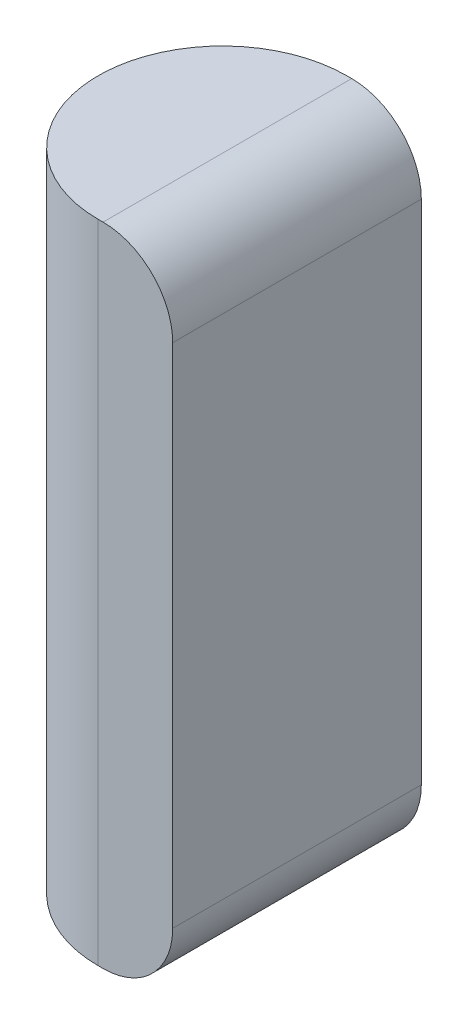
ISO-10303-21;
HEADER;
FILE_DESCRIPTION(('STEP AP214'),'2;1');
FILE_NAME('part.step','',(''),(''),'','','');
FILE_SCHEMA(('AUTOMOTIVE_DESIGN { 1 0 10303 214 1 1 1 1 }'));
ENDSEC;
DATA;
#1=APPLICATION_CONTEXT('core data for automotive mechanical design processes');
#2=APPLICATION_PROTOCOL_DEFINITION('international standard','automotive_design',2000,#1);
#3=PRODUCT_CONTEXT('',#1,'mechanical');
#4=PRODUCT('Part','Part','',(#3));
#5=PRODUCT_RELATED_PRODUCT_CATEGORY('part','',(#4));
#6=PRODUCT_DEFINITION_FORMATION('','',#4);
#7=PRODUCT_DEFINITION_CONTEXT('part definition',#1,'design');
#8=PRODUCT_DEFINITION('design','',#6,#7);
#9=PRODUCT_DEFINITION_SHAPE('','',#8);
#10=(LENGTH_UNIT() NAMED_UNIT(*) SI_UNIT(.MILLI.,.METRE.));
#11=(NAMED_UNIT(*) PLANE_ANGLE_UNIT() SI_UNIT($,.RADIAN.));
#12=(NAMED_UNIT(*) SI_UNIT($,.STERADIAN.) SOLID_ANGLE_UNIT());
#13=UNCERTAINTY_MEASURE_WITH_UNIT(LENGTH_MEASURE(1.E-05),#10,'distance_accuracy_value','');
#14=(GEOMETRIC_REPRESENTATION_CONTEXT(3) GLOBAL_UNCERTAINTY_ASSIGNED_CONTEXT((#13)) GLOBAL_UNIT_ASSIGNED_CONTEXT((#10,
#11,#12)) REPRESENTATION_CONTEXT('',''));
#15=CARTESIAN_POINT('',(0.,0.,0.));
#16=DIRECTION('',(0.,0.,1.));
#17=DIRECTION('',(1.,0.,0.));
#18=AXIS2_PLACEMENT_3D('',#15,#16,#17);
#19=CARTESIAN_POINT('',(0.,0.,0.));
#20=DIRECTION('',(0.,1.,0.));
#21=DIRECTION('',(0.,0.,1.));
#22=AXIS2_PLACEMENT_3D('',#19,#20,#21);
#23=PLANE('',#22);
#24=DIRECTION('',(1.,0.,0.));
#25=VECTOR('',#24,1.);
#26=CARTESIAN_POINT('',(0.,0.,0.125));
#27=LINE('',#26,#25);
#28=CARTESIAN_POINT('',(0.725,0.,0.125));
#29=VERTEX_POINT('',#28);
#30=CARTESIAN_POINT('',(0.73,0.,0.125));
#31=VERTEX_POINT('',#30);
#32=EDGE_CURVE('E11',#29,#31,#27,.T.);
#33=ORIENTED_EDGE('',*,*,#32,.F.);
#34=CARTESIAN_POINT('',(0.725,0.,0.));
#35=DIRECTION('',(0.,1.,0.));
#36=DIRECTION('',(0.,0.,1.));
#37=AXIS2_PLACEMENT_3D('',#34,#35,#36);
#38=CIRCLE('',#37,0.125);
#39=CARTESIAN_POINT('',(0.725,0.,-0.125));
#40=VERTEX_POINT('',#39);
#41=EDGE_CURVE('E24',#40,#29,#38,.T.);
#42=ORIENTED_EDGE('',*,*,#41,.F.);
#43=DIRECTION('',(-1.,0.,0.));
#44=VECTOR('',#43,1.);
#45=CARTESIAN_POINT('',(0.,0.,-0.125));
#46=LINE('',#45,#44);
#47=CARTESIAN_POINT('',(0.73,0.,-0.125));
#48=VERTEX_POINT('',#47);
#49=EDGE_CURVE('E117',#48,#40,#46,.T.);
#50=ORIENTED_EDGE('',*,*,#49,.F.);
#51=DIRECTION('',(0.,0.,1.));
#52=VECTOR('',#51,1.);
#53=CARTESIAN_POINT('',(0.73,0.,0.));
#54=LINE('',#53,#52);
#55=EDGE_CURVE('E115',#48,#31,#54,.T.);
#56=ORIENTED_EDGE('',*,*,#55,.T.);
#57=EDGE_LOOP('',(#33,#42,#50,#56));
#58=FACE_BOUND('',#57,.T.);
#59=ADVANCED_FACE('F17',(#58),#23,.F.);
#60=CARTESIAN_POINT('',(0.73,0.07,0.4));
#61=DIRECTION('',(0.,0.,-1.));
#62=DIRECTION('',(-1.,0.,0.));
#63=AXIS2_PLACEMENT_3D('',#60,#61,#62);
#64=CYLINDRICAL_SURFACE('',#63,0.07);
#65=DIRECTION('',(0.,0.,-1.));
#66=VECTOR('',#65,1.);
#67=CARTESIAN_POINT('',(0.8,0.07,0.4));
#68=LINE('',#67,#66);
#69=CARTESIAN_POINT('',(0.8,0.07,0.125));
#70=VERTEX_POINT('',#69);
#71=CARTESIAN_POINT('',(0.8,0.07,-0.125));
#72=VERTEX_POINT('',#71);
#73=EDGE_CURVE('E113',#70,#72,#68,.T.);
#74=ORIENTED_EDGE('',*,*,#73,.F.);
#75=CARTESIAN_POINT('',(0.73,0.07,0.125));
#76=DIRECTION('',(0.,0.,-1.));
#77=DIRECTION('',(1.,0.,0.));
#78=AXIS2_PLACEMENT_3D('',#75,#76,#77);
#79=CIRCLE('',#78,0.07);
#80=EDGE_CURVE('E110',#70,#31,#79,.T.);
#81=ORIENTED_EDGE('',*,*,#80,.T.);
#82=ORIENTED_EDGE('',*,*,#55,.F.);
#83=CARTESIAN_POINT('',(0.73,0.07,-0.125));
#84=DIRECTION('',(0.,0.,1.));
#85=DIRECTION('',(-1.,0.,0.));
#86=AXIS2_PLACEMENT_3D('',#83,#84,#85);
#87=CIRCLE('',#86,0.07);
#88=EDGE_CURVE('E107',#48,#72,#87,.T.);
#89=ORIENTED_EDGE('',*,*,#88,.T.);
#90=EDGE_LOOP('',(#74,#81,#82,#89));
#91=FACE_BOUND('',#90,.T.);
#92=ADVANCED_FACE('F127',(#91),#64,.T.);
#93=CARTESIAN_POINT('',(0.8,0.65,0.4));
#94=DIRECTION('',(-1.,0.,0.));
#95=DIRECTION('',(0.,0.,1.));
#96=AXIS2_PLACEMENT_3D('',#93,#94,#95);
#97=PLANE('',#96);
#98=DIRECTION('',(0.,1.,0.));
#99=VECTOR('',#98,1.);
#100=CARTESIAN_POINT('',(0.8,0.,0.125));
#101=LINE('',#100,#99);
#102=CARTESIAN_POINT('',(0.8,0.58,0.125));
#103=VERTEX_POINT('',#102);
#104=EDGE_CURVE('E105',#70,#103,#101,.T.);
#105=ORIENTED_EDGE('',*,*,#104,.F.);
#106=ORIENTED_EDGE('',*,*,#73,.T.);
#107=DIRECTION('',(0.,-1.,0.));
#108=VECTOR('',#107,1.);
#109=CARTESIAN_POINT('',(0.8,0.65,-0.125));
#110=LINE('',#109,#108);
#111=CARTESIAN_POINT('',(0.8,0.58,-0.125));
#112=VERTEX_POINT('',#111);
#113=EDGE_CURVE('E103',#112,#72,#110,.T.);
#114=ORIENTED_EDGE('',*,*,#113,.F.);
#115=DIRECTION('',(0.,0.,1.));
#116=VECTOR('',#115,1.);
#117=CARTESIAN_POINT('',(0.8,0.58,0.4));
#118=LINE('',#117,#116);
#119=EDGE_CURVE('E91',#112,#103,#118,.T.);
#120=ORIENTED_EDGE('',*,*,#119,.T.);
#121=EDGE_LOOP('',(#105,#106,#114,#120));
#122=FACE_BOUND('',#121,.T.);
#123=ADVANCED_FACE('F123',(#122),#97,.F.);
#124=CARTESIAN_POINT('',(0.,0.65,0.));
#125=DIRECTION('',(0.,1.,0.));
#126=DIRECTION('',(0.,0.,1.));
#127=AXIS2_PLACEMENT_3D('',#124,#125,#126);
#128=PLANE('',#127);
#129=CARTESIAN_POINT('',(0.725,0.65,0.));
#130=DIRECTION('',(0.,1.,0.));
#131=DIRECTION('',(0.,0.,1.));
#132=AXIS2_PLACEMENT_3D('',#129,#130,#131);
#133=CIRCLE('',#132,0.125);
#134=CARTESIAN_POINT('',(0.725,0.65,-0.125));
#135=VERTEX_POINT('',#134);
#136=CARTESIAN_POINT('',(0.725,0.65,0.125));
#137=VERTEX_POINT('',#136);
#138=EDGE_CURVE('E100',#135,#137,#133,.T.);
#139=ORIENTED_EDGE('',*,*,#138,.T.);
#140=DIRECTION('',(1.,0.,0.));
#141=VECTOR('',#140,1.);
#142=CARTESIAN_POINT('',(0.,0.65,0.125));
#143=LINE('',#142,#141);
#144=CARTESIAN_POINT('',(0.73,0.65,0.125));
#145=VERTEX_POINT('',#144);
#146=EDGE_CURVE('E72',#137,#145,#143,.T.);
#147=ORIENTED_EDGE('',*,*,#146,.T.);
#148=DIRECTION('',(0.,0.,-1.));
#149=VECTOR('',#148,1.);
#150=CARTESIAN_POINT('',(0.73,0.65,-0.4));
#151=LINE('',#150,#149);
#152=CARTESIAN_POINT('',(0.73,0.65,-0.125));
#153=VERTEX_POINT('',#152);
#154=EDGE_CURVE('E66',#145,#153,#151,.T.);
#155=ORIENTED_EDGE('',*,*,#154,.T.);
#156=DIRECTION('',(-1.,0.,0.));
#157=VECTOR('',#156,1.);
#158=CARTESIAN_POINT('',(0.,0.65,-0.125));
#159=LINE('',#158,#157);
#160=EDGE_CURVE('E69',#153,#135,#159,.T.);
#161=ORIENTED_EDGE('',*,*,#160,.T.);
#162=EDGE_LOOP('',(#139,#147,#155,#161));
#163=FACE_BOUND('',#162,.T.);
#164=ADVANCED_FACE('F68',(#163),#128,.T.);
#165=CARTESIAN_POINT('',(0.73,0.58,0.));
#166=DIRECTION('',(0.,0.,1.));
#167=DIRECTION('',(1.,0.,0.));
#168=AXIS2_PLACEMENT_3D('',#165,#166,#167);
#169=CYLINDRICAL_SURFACE('',#168,0.07);
#170=ORIENTED_EDGE('',*,*,#154,.F.);
#171=CARTESIAN_POINT('',(0.73,0.58,0.125));
#172=DIRECTION('',(0.,0.,-1.));
#173=DIRECTION('',(1.,0.,0.));
#174=AXIS2_PLACEMENT_3D('',#171,#172,#173);
#175=CIRCLE('',#174,0.07);
#176=EDGE_CURVE('E86',#145,#103,#175,.T.);
#177=ORIENTED_EDGE('',*,*,#176,.T.);
#178=ORIENTED_EDGE('',*,*,#119,.F.);
#179=CARTESIAN_POINT('',(0.73,0.58,-0.125));
#180=DIRECTION('',(0.,0.,1.));
#181=DIRECTION('',(-1.,0.,0.));
#182=AXIS2_PLACEMENT_3D('',#179,#180,#181);
#183=CIRCLE('',#182,0.07);
#184=EDGE_CURVE('E82',#112,#153,#183,.T.);
#185=ORIENTED_EDGE('',*,*,#184,.T.);
#186=EDGE_LOOP('',(#170,#177,#178,#185));
#187=FACE_BOUND('',#186,.T.);
#188=ADVANCED_FACE('F89',(#187),#169,.T.);
#189=CARTESIAN_POINT('',(0.725,0.,0.125));
#190=DIRECTION('',(0.,0.,1.));
#191=DIRECTION('',(1.,0.,0.));
#192=AXIS2_PLACEMENT_3D('',#189,#190,#191);
#193=PLANE('',#192);
#194=ORIENTED_EDGE('',*,*,#176,.F.);
#195=ORIENTED_EDGE('',*,*,#146,.F.);
#196=DIRECTION('',(0.,1.,0.));
#197=VECTOR('',#196,1.);
#198=CARTESIAN_POINT('',(0.725,0.,0.125));
#199=LINE('',#198,#197);
#200=EDGE_CURVE('E92',#29,#137,#199,.T.);
#201=ORIENTED_EDGE('',*,*,#200,.F.);
#202=ORIENTED_EDGE('',*,*,#32,.T.);
#203=ORIENTED_EDGE('',*,*,#80,.F.);
#204=ORIENTED_EDGE('',*,*,#104,.T.);
#205=EDGE_LOOP('',(#194,#195,#201,#202,#203,#204));
#206=FACE_BOUND('',#205,.T.);
#207=ADVANCED_FACE('F120',(#206),#193,.T.);
#208=CARTESIAN_POINT('',(0.8,0.,-0.125));
#209=DIRECTION('',(0.,0.,-1.));
#210=DIRECTION('',(-1.,0.,0.));
#211=AXIS2_PLACEMENT_3D('',#208,#209,#210);
#212=PLANE('',#211);
#213=ORIENTED_EDGE('',*,*,#184,.F.);
#214=ORIENTED_EDGE('',*,*,#113,.T.);
#215=ORIENTED_EDGE('',*,*,#88,.F.);
#216=ORIENTED_EDGE('',*,*,#49,.T.);
#217=DIRECTION('',(0.,1.,0.));
#218=VECTOR('',#217,1.);
#219=CARTESIAN_POINT('',(0.725,0.,-0.125));
#220=LINE('',#219,#218);
#221=EDGE_CURVE('E85',#40,#135,#220,.T.);
#222=ORIENTED_EDGE('',*,*,#221,.T.);
#223=ORIENTED_EDGE('',*,*,#160,.F.);
#224=EDGE_LOOP('',(#213,#214,#215,#216,#222,#223));
#225=FACE_BOUND('',#224,.T.);
#226=ADVANCED_FACE('F80',(#225),#212,.T.);
#227=CARTESIAN_POINT('',(0.725,0.,0.));
#228=DIRECTION('',(0.,1.,0.));
#229=DIRECTION('',(0.,0.,1.));
#230=AXIS2_PLACEMENT_3D('',#227,#228,#229);
#231=CYLINDRICAL_SURFACE('',#230,0.125);
#232=ORIENTED_EDGE('',*,*,#138,.F.);
#233=ORIENTED_EDGE('',*,*,#221,.F.);
#234=ORIENTED_EDGE('',*,*,#41,.T.);
#235=ORIENTED_EDGE('',*,*,#200,.T.);
#236=EDGE_LOOP('',(#232,#233,#234,#235));
#237=FACE_BOUND('',#236,.T.);
#238=ADVANCED_FACE('F119',(#237),#231,.T.);
#239=CLOSED_SHELL('',(#59,#92,#123,#164,#188,#207,#226,#238));
#240=MANIFOLD_SOLID_BREP('B1',#239);
#241=ADVANCED_BREP_SHAPE_REPRESENTATION('',(#18,#240),#14);
#242=SHAPE_DEFINITION_REPRESENTATION(#9,#241);
ENDSEC;
END-ISO-10303-21;
